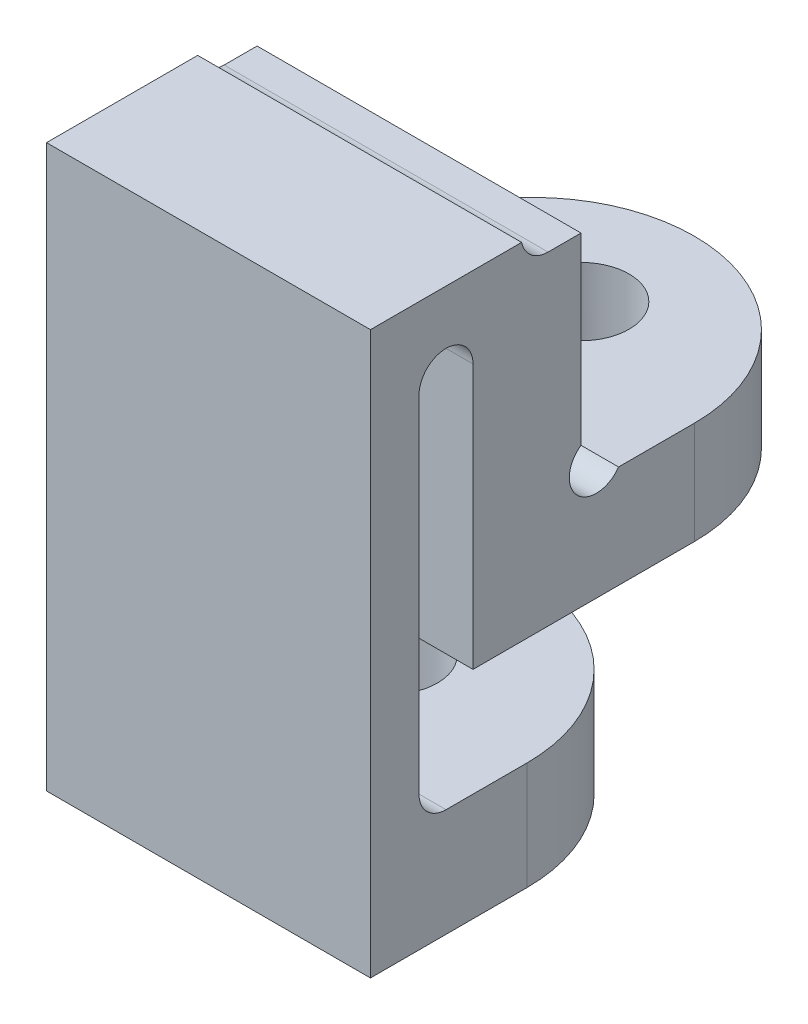
ISO-10303-21;
HEADER;
FILE_DESCRIPTION(('STEP AP214'),'2;1');
FILE_NAME('part.step','',(''),(''),'','','');
FILE_SCHEMA(('AUTOMOTIVE_DESIGN { 1 0 10303 214 1 1 1 1 }'));
ENDSEC;
DATA;
#1=APPLICATION_CONTEXT('core data for automotive mechanical design processes');
#2=APPLICATION_PROTOCOL_DEFINITION('international standard','automotive_design',2000,#1);
#3=PRODUCT_CONTEXT('',#1,'mechanical');
#4=PRODUCT('Part','Part','',(#3));
#5=PRODUCT_RELATED_PRODUCT_CATEGORY('part','',(#4));
#6=PRODUCT_DEFINITION_FORMATION('','',#4);
#7=PRODUCT_DEFINITION_CONTEXT('part definition',#1,'design');
#8=PRODUCT_DEFINITION('design','',#6,#7);
#9=PRODUCT_DEFINITION_SHAPE('','',#8);
#10=(LENGTH_UNIT() NAMED_UNIT(*) SI_UNIT(.MILLI.,.METRE.));
#11=(NAMED_UNIT(*) PLANE_ANGLE_UNIT() SI_UNIT($,.RADIAN.));
#12=(NAMED_UNIT(*) SI_UNIT($,.STERADIAN.) SOLID_ANGLE_UNIT());
#13=UNCERTAINTY_MEASURE_WITH_UNIT(LENGTH_MEASURE(1.E-05),#10,'distance_accuracy_value','');
#14=(GEOMETRIC_REPRESENTATION_CONTEXT(3) GLOBAL_UNCERTAINTY_ASSIGNED_CONTEXT((#13)) GLOBAL_UNIT_ASSIGNED_CONTEXT((#10,
#11,#12)) REPRESENTATION_CONTEXT('',''));
#15=CARTESIAN_POINT('',(0.,0.,0.));
#16=DIRECTION('',(0.,0.,1.));
#17=DIRECTION('',(1.,0.,0.));
#18=AXIS2_PLACEMENT_3D('',#15,#16,#17);
#19=CARTESIAN_POINT('',(1.5,6.89757709877801,2.9));
#20=DIRECTION('',(0.,0.,1.));
#21=DIRECTION('',(0.,-1.,0.));
#22=AXIS2_PLACEMENT_3D('',#19,#20,#21);
#23=PLANE('',#22);
#24=DIRECTION('',(0.,-1.,0.));
#25=VECTOR('',#24,1.);
#26=CARTESIAN_POINT('',(7.5,6.89757709877801,2.9));
#27=LINE('',#26,#25);
#28=CARTESIAN_POINT('',(7.5,6.89757709877801,2.9));
#29=VERTEX_POINT('',#28);
#30=CARTESIAN_POINT('',(7.5,-3.50242290122199,2.9));
#31=VERTEX_POINT('',#30);
#32=EDGE_CURVE('E213',#29,#31,#27,.T.);
#33=ORIENTED_EDGE('',*,*,#32,.F.);
#34=DIRECTION('',(1.,0.,0.));
#35=VECTOR('',#34,1.);
#36=CARTESIAN_POINT('',(1.5,6.89757709877801,2.9));
#37=LINE('',#36,#35);
#38=CARTESIAN_POINT('',(1.5,6.89757709877801,2.9));
#39=VERTEX_POINT('',#38);
#40=EDGE_CURVE('E274',#39,#29,#37,.T.);
#41=ORIENTED_EDGE('',*,*,#40,.F.);
#42=DIRECTION('',(0.,-1.,0.));
#43=VECTOR('',#42,1.);
#44=CARTESIAN_POINT('',(1.5,6.89757709877801,2.9));
#45=LINE('',#44,#43);
#46=CARTESIAN_POINT('',(1.5,-3.50242290122199,2.9));
#47=VERTEX_POINT('',#46);
#48=EDGE_CURVE('E214',#39,#47,#45,.T.);
#49=ORIENTED_EDGE('',*,*,#48,.T.);
#50=DIRECTION('',(1.,0.,0.));
#51=VECTOR('',#50,1.);
#52=CARTESIAN_POINT('',(1.5,-3.50242290122199,2.9));
#53=LINE('',#52,#51);
#54=EDGE_CURVE('E245',#47,#31,#53,.T.);
#55=ORIENTED_EDGE('',*,*,#54,.T.);
#56=EDGE_LOOP('',(#33,#41,#49,#55));
#57=FACE_BOUND('',#56,.T.);
#58=ADVANCED_FACE('F45',(#57),#23,.T.);
#59=CARTESIAN_POINT('',(1.5,6.89757709877801,-6.1));
#60=DIRECTION('',(0.,1.,0.));
#61=DIRECTION('',(0.,0.,1.));
#62=AXIS2_PLACEMENT_3D('',#59,#60,#61);
#63=PLANE('',#62);
#64=DIRECTION('',(1.,0.,0.));
#65=VECTOR('',#64,1.);
#66=CARTESIAN_POINT('',(1.5,6.89757709877801,0.1));
#67=LINE('',#66,#65);
#68=CARTESIAN_POINT('',(1.5,6.89757709877801,0.0999999999999998));
#69=VERTEX_POINT('',#68);
#70=CARTESIAN_POINT('',(7.5,6.89757709877801,0.0999999999999998));
#71=VERTEX_POINT('',#70);
#72=EDGE_CURVE('E209',#69,#71,#67,.T.);
#73=ORIENTED_EDGE('',*,*,#72,.F.);
#74=DIRECTION('',(0.,0.,1.));
#75=VECTOR('',#74,1.);
#76=CARTESIAN_POINT('',(1.5,6.89757709877801,-6.1));
#77=LINE('',#76,#75);
#78=EDGE_CURVE('E242',#69,#39,#77,.T.);
#79=ORIENTED_EDGE('',*,*,#78,.T.);
#80=ORIENTED_EDGE('',*,*,#40,.T.);
#81=DIRECTION('',(0.,0.,1.));
#82=VECTOR('',#81,1.);
#83=CARTESIAN_POINT('',(7.5,6.89757709877801,-6.1));
#84=LINE('',#83,#82);
#85=EDGE_CURVE('E219',#71,#29,#84,.T.);
#86=ORIENTED_EDGE('',*,*,#85,.F.);
#87=EDGE_LOOP('',(#73,#79,#80,#86));
#88=FACE_BOUND('',#87,.T.);
#89=ADVANCED_FACE('F434',(#88),#63,.T.);
#90=CARTESIAN_POINT('',(1.5,0.497577098778013,-6.1));
#91=DIRECTION('',(0.,-1.,0.));
#92=DIRECTION('',(0.,0.,-1.));
#93=AXIS2_PLACEMENT_3D('',#90,#91,#92);
#94=PLANE('',#93);
#95=CARTESIAN_POINT('',(4.5,0.497577098778013,-3.99999999999999));
#96=DIRECTION('',(0.,-1.,0.));
#97=DIRECTION('',(0.,0.,-1.));
#98=AXIS2_PLACEMENT_3D('',#95,#96,#97);
#99=CIRCLE('',#98,0.888999999999994);
#100=CARTESIAN_POINT('',(4.5,0.497577098778013,-4.88899999999999));
#101=VERTEX_POINT('',#100);
#102=EDGE_CURVE('E339',#101,#101,#99,.T.);
#103=ORIENTED_EDGE('',*,*,#102,.F.);
#104=EDGE_LOOP('',(#103));
#105=FACE_BOUND('',#104,.T.);
#106=CARTESIAN_POINT('',(4.5,0.497577098778013,-3.1));
#107=DIRECTION('',(0.,-1.,0.));
#108=DIRECTION('',(0.,0.,-1.));
#109=AXIS2_PLACEMENT_3D('',#106,#107,#108);
#110=CIRCLE('',#109,3.);
#111=CARTESIAN_POINT('',(1.5,0.497577098778013,-3.1));
#112=VERTEX_POINT('',#111);
#113=CARTESIAN_POINT('',(4.5,0.497577098778013,-6.1));
#114=VERTEX_POINT('',#113);
#115=EDGE_CURVE('E307',#112,#114,#110,.T.);
#116=ORIENTED_EDGE('',*,*,#115,.T.);
#117=CARTESIAN_POINT('',(4.5,0.497577098778013,-3.1));
#118=DIRECTION('',(0.,-1.,0.));
#119=DIRECTION('',(0.,0.,-1.));
#120=AXIS2_PLACEMENT_3D('',#117,#118,#119);
#121=CIRCLE('',#120,3.);
#122=CARTESIAN_POINT('',(7.5,0.497577098778013,-3.1));
#123=VERTEX_POINT('',#122);
#124=EDGE_CURVE('E310',#114,#123,#121,.T.);
#125=ORIENTED_EDGE('',*,*,#124,.T.);
#126=DIRECTION('',(0.,0.,-1.));
#127=VECTOR('',#126,1.);
#128=CARTESIAN_POINT('',(7.5,0.497577098778013,-6.1));
#129=LINE('',#128,#127);
#130=CARTESIAN_POINT('',(7.5,0.497577098778013,1.));
#131=VERTEX_POINT('',#130);
#132=EDGE_CURVE('E268',#131,#123,#129,.T.);
#133=ORIENTED_EDGE('',*,*,#132,.F.);
#134=DIRECTION('',(1.,0.,0.));
#135=VECTOR('',#134,1.);
#136=CARTESIAN_POINT('',(1.5,0.497577098778013,1.));
#137=LINE('',#136,#135);
#138=CARTESIAN_POINT('',(1.5,0.497577098778013,1.));
#139=VERTEX_POINT('',#138);
#140=EDGE_CURVE('E279',#139,#131,#137,.T.);
#141=ORIENTED_EDGE('',*,*,#140,.F.);
#142=DIRECTION('',(0.,0.,-1.));
#143=VECTOR('',#142,1.);
#144=CARTESIAN_POINT('',(1.5,0.497577098778013,-6.1));
#145=LINE('',#144,#143);
#146=EDGE_CURVE('E238',#139,#112,#145,.T.);
#147=ORIENTED_EDGE('',*,*,#146,.T.);
#148=EDGE_LOOP('',(#116,#125,#133,#141,#147));
#149=FACE_BOUND('',#148,.T.);
#150=ADVANCED_FACE('F390',(#105,#149),#94,.T.);
#151=CARTESIAN_POINT('',(1.5,0.497577098778013,1.));
#152=DIRECTION('',(0.,0.,1.));
#153=DIRECTION('',(0.,-1.,0.));
#154=AXIS2_PLACEMENT_3D('',#151,#152,#153);
#155=PLANE('',#154);
#156=DIRECTION('',(0.,-1.,0.));
#157=VECTOR('',#156,1.);
#158=CARTESIAN_POINT('',(7.5,0.497577098778013,1.));
#159=LINE('',#158,#157);
#160=CARTESIAN_POINT('',(7.5,5.39757709877801,0.999999999999999));
#161=VERTEX_POINT('',#160);
#162=EDGE_CURVE('E264',#161,#131,#159,.T.);
#163=ORIENTED_EDGE('',*,*,#162,.F.);
#164=DIRECTION('',(1.,0.,0.));
#165=VECTOR('',#164,1.);
#166=CARTESIAN_POINT('',(1.5,5.39757709877801,0.999999999999999));
#167=LINE('',#166,#165);
#168=CARTESIAN_POINT('',(1.5,5.39757709877801,0.999999999999999));
#169=VERTEX_POINT('',#168);
#170=EDGE_CURVE('E282',#169,#161,#167,.T.);
#171=ORIENTED_EDGE('',*,*,#170,.F.);
#172=DIRECTION('',(0.,-1.,0.));
#173=VECTOR('',#172,1.);
#174=CARTESIAN_POINT('',(1.5,0.497577098778013,1.));
#175=LINE('',#174,#173);
#176=EDGE_CURVE('E234',#169,#139,#175,.T.);
#177=ORIENTED_EDGE('',*,*,#176,.T.);
#178=ORIENTED_EDGE('',*,*,#140,.T.);
#179=EDGE_LOOP('',(#163,#171,#177,#178));
#180=FACE_BOUND('',#179,.T.);
#181=ADVANCED_FACE('F394',(#180),#155,.T.);
#182=CARTESIAN_POINT('',(1.5,5.39757709877801,1.5));
#183=DIRECTION('',(1.,0.,0.));
#184=DIRECTION('',(0.,0.,-1.));
#185=AXIS2_PLACEMENT_3D('',#182,#183,#184);
#186=CYLINDRICAL_SURFACE('',#185,0.500000000000001);
#187=CARTESIAN_POINT('',(7.5,5.39757709877801,1.5));
#188=DIRECTION('',(-1.,0.,0.));
#189=DIRECTION('',(0.,0.,1.));
#190=AXIS2_PLACEMENT_3D('',#187,#188,#189);
#191=CIRCLE('',#190,0.500000000000001);
#192=CARTESIAN_POINT('',(7.5,5.39757709877801,2.));
#193=VERTEX_POINT('',#192);
#194=EDGE_CURVE('E260',#193,#161,#191,.T.);
#195=ORIENTED_EDGE('',*,*,#194,.F.);
#196=DIRECTION('',(1.,0.,0.));
#197=VECTOR('',#196,1.);
#198=CARTESIAN_POINT('',(1.5,5.39757709877801,2.));
#199=LINE('',#198,#197);
#200=CARTESIAN_POINT('',(1.5,5.39757709877801,2.));
#201=VERTEX_POINT('',#200);
#202=EDGE_CURVE('E285',#201,#193,#199,.T.);
#203=ORIENTED_EDGE('',*,*,#202,.F.);
#204=CARTESIAN_POINT('',(1.5,5.39757709877801,1.5));
#205=DIRECTION('',(-1.,0.,0.));
#206=DIRECTION('',(0.,0.,1.));
#207=AXIS2_PLACEMENT_3D('',#204,#205,#206);
#208=CIRCLE('',#207,0.500000000000001);
#209=EDGE_CURVE('E230',#201,#169,#208,.T.);
#210=ORIENTED_EDGE('',*,*,#209,.T.);
#211=ORIENTED_EDGE('',*,*,#170,.T.);
#212=EDGE_LOOP('',(#195,#203,#210,#211));
#213=FACE_BOUND('',#212,.T.);
#214=ADVANCED_FACE('F401',(#213),#186,.F.);
#215=CARTESIAN_POINT('',(1.5,0.497577098778013,2.));
#216=DIRECTION('',(0.,0.,-1.));
#217=DIRECTION('',(0.,1.,0.));
#218=AXIS2_PLACEMENT_3D('',#215,#216,#217);
#219=PLANE('',#218);
#220=DIRECTION('',(0.,1.,0.));
#221=VECTOR('',#220,1.);
#222=CARTESIAN_POINT('',(7.5,0.497577098778013,2.));
#223=LINE('',#222,#221);
#224=CARTESIAN_POINT('',(7.5,-1.00242290122199,2.));
#225=VERTEX_POINT('',#224);
#226=EDGE_CURVE('E257',#225,#193,#223,.T.);
#227=ORIENTED_EDGE('',*,*,#226,.F.);
#228=DIRECTION('',(1.,0.,0.));
#229=VECTOR('',#228,1.);
#230=CARTESIAN_POINT('',(1.5,-1.00242290122199,2.));
#231=LINE('',#230,#229);
#232=CARTESIAN_POINT('',(1.5,-1.00242290122199,2.));
#233=VERTEX_POINT('',#232);
#234=EDGE_CURVE('E343',#225,#233,#231,.F.);
#235=ORIENTED_EDGE('',*,*,#234,.T.);
#236=DIRECTION('',(0.,1.,0.));
#237=VECTOR('',#236,1.);
#238=CARTESIAN_POINT('',(1.5,0.497577098778013,2.));
#239=LINE('',#238,#237);
#240=EDGE_CURVE('E227',#233,#201,#239,.T.);
#241=ORIENTED_EDGE('',*,*,#240,.T.);
#242=ORIENTED_EDGE('',*,*,#202,.T.);
#243=EDGE_LOOP('',(#227,#235,#241,#242));
#244=FACE_BOUND('',#243,.T.);
#245=ADVANCED_FACE('F404',(#244),#219,.T.);
#246=CARTESIAN_POINT('',(1.5,-1.50242290122199,2.));
#247=DIRECTION('',(0.,1.,0.));
#248=DIRECTION('',(0.,0.,1.));
#249=AXIS2_PLACEMENT_3D('',#246,#247,#248);
#250=PLANE('',#249);
#251=CARTESIAN_POINT('',(4.5,-1.50242290122199,-0.45));
#252=DIRECTION('',(0.,1.,0.));
#253=DIRECTION('',(0.,0.,1.));
#254=AXIS2_PLACEMENT_3D('',#251,#252,#253);
#255=CIRCLE('',#254,0.888999999999989);
#256=CARTESIAN_POINT('',(4.5,-1.50242290122199,0.438999999999989));
#257=VERTEX_POINT('',#256);
#258=EDGE_CURVE('E178',#257,#257,#255,.T.);
#259=ORIENTED_EDGE('',*,*,#258,.F.);
#260=EDGE_LOOP('',(#259));
#261=FACE_BOUND('',#260,.T.);
#262=DIRECTION('',(0.,0.,1.));
#263=VECTOR('',#262,1.);
#264=CARTESIAN_POINT('',(1.5,-1.50242290122199,2.));
#265=LINE('',#264,#263);
#266=CARTESIAN_POINT('',(1.5,-1.50242290122199,0.));
#267=VERTEX_POINT('',#266);
#268=CARTESIAN_POINT('',(1.5,-1.50242290122199,1.5));
#269=VERTEX_POINT('',#268);
#270=EDGE_CURVE('E223',#267,#269,#265,.T.);
#271=ORIENTED_EDGE('',*,*,#270,.T.);
#272=DIRECTION('',(1.,0.,0.));
#273=VECTOR('',#272,1.);
#274=CARTESIAN_POINT('',(7.5,-1.50242290122199,1.5));
#275=LINE('',#274,#273);
#276=CARTESIAN_POINT('',(7.5,-1.50242290122199,1.5));
#277=VERTEX_POINT('',#276);
#278=EDGE_CURVE('E331',#269,#277,#275,.T.);
#279=ORIENTED_EDGE('',*,*,#278,.T.);
#280=DIRECTION('',(0.,0.,1.));
#281=VECTOR('',#280,1.);
#282=CARTESIAN_POINT('',(7.5,-1.50242290122199,2.));
#283=LINE('',#282,#281);
#284=CARTESIAN_POINT('',(7.5,-1.50242290122199,0.));
#285=VERTEX_POINT('',#284);
#286=EDGE_CURVE('E253',#285,#277,#283,.T.);
#287=ORIENTED_EDGE('',*,*,#286,.F.);
#288=CARTESIAN_POINT('',(4.5,-1.50242290122199,0.));
#289=DIRECTION('',(0.,1.,0.));
#290=DIRECTION('',(0.,0.,1.));
#291=AXIS2_PLACEMENT_3D('',#288,#289,#290);
#292=CIRCLE('',#291,3.);
#293=CARTESIAN_POINT('',(4.5,-1.50242290122199,-3.));
#294=VERTEX_POINT('',#293);
#295=EDGE_CURVE('E322',#285,#294,#292,.T.);
#296=ORIENTED_EDGE('',*,*,#295,.T.);
#297=CARTESIAN_POINT('',(4.5,-1.50242290122199,0.));
#298=DIRECTION('',(0.,1.,0.));
#299=DIRECTION('',(0.,0.,1.));
#300=AXIS2_PLACEMENT_3D('',#297,#298,#299);
#301=CIRCLE('',#300,3.);
#302=EDGE_CURVE('E319',#294,#267,#301,.T.);
#303=ORIENTED_EDGE('',*,*,#302,.T.);
#304=EDGE_LOOP('',(#271,#279,#287,#296,#303));
#305=FACE_BOUND('',#304,.T.);
#306=ADVANCED_FACE('F413',(#261,#305),#250,.T.);
#307=CARTESIAN_POINT('',(1.5,-3.50242290122199,-3.));
#308=DIRECTION('',(0.,-1.,0.));
#309=DIRECTION('',(0.,0.,-1.));
#310=AXIS2_PLACEMENT_3D('',#307,#308,#309);
#311=PLANE('',#310);
#312=CARTESIAN_POINT('',(4.5,-3.50242290122199,-0.45));
#313=DIRECTION('',(0.,-1.,0.));
#314=DIRECTION('',(0.,0.,-1.));
#315=AXIS2_PLACEMENT_3D('',#312,#313,#314);
#316=CIRCLE('',#315,0.888999999999994);
#317=CARTESIAN_POINT('',(4.5,-3.50242290122199,-1.33899999999999));
#318=VERTEX_POINT('',#317);
#319=EDGE_CURVE('E358',#318,#318,#316,.T.);
#320=ORIENTED_EDGE('',*,*,#319,.F.);
#321=EDGE_LOOP('',(#320));
#322=FACE_BOUND('',#321,.T.);
#323=CARTESIAN_POINT('',(4.5,-3.50242290122199,0.));
#324=DIRECTION('',(0.,-1.,0.));
#325=DIRECTION('',(0.,0.,-1.));
#326=AXIS2_PLACEMENT_3D('',#323,#324,#325);
#327=CIRCLE('',#326,3.);
#328=CARTESIAN_POINT('',(1.5,-3.50242290122199,0.));
#329=VERTEX_POINT('',#328);
#330=CARTESIAN_POINT('',(4.5,-3.50242290122199,-3.));
#331=VERTEX_POINT('',#330);
#332=EDGE_CURVE('E325',#329,#331,#327,.T.);
#333=ORIENTED_EDGE('',*,*,#332,.T.);
#334=CARTESIAN_POINT('',(4.5,-3.50242290122199,0.));
#335=DIRECTION('',(0.,-1.,0.));
#336=DIRECTION('',(0.,0.,-1.));
#337=AXIS2_PLACEMENT_3D('',#334,#335,#336);
#338=CIRCLE('',#337,3.);
#339=CARTESIAN_POINT('',(7.5,-3.50242290122199,0.));
#340=VERTEX_POINT('',#339);
#341=EDGE_CURVE('E328',#331,#340,#338,.T.);
#342=ORIENTED_EDGE('',*,*,#341,.T.);
#343=DIRECTION('',(0.,0.,-1.));
#344=VECTOR('',#343,1.);
#345=CARTESIAN_POINT('',(7.5,-3.50242290122199,-3.));
#346=LINE('',#345,#344);
#347=EDGE_CURVE('E249',#31,#340,#346,.T.);
#348=ORIENTED_EDGE('',*,*,#347,.F.);
#349=ORIENTED_EDGE('',*,*,#54,.F.);
#350=DIRECTION('',(0.,0.,-1.));
#351=VECTOR('',#350,1.);
#352=CARTESIAN_POINT('',(1.5,-3.50242290122199,-3.));
#353=LINE('',#352,#351);
#354=EDGE_CURVE('E218',#47,#329,#353,.T.);
#355=ORIENTED_EDGE('',*,*,#354,.T.);
#356=EDGE_LOOP('',(#333,#342,#348,#349,#355));
#357=FACE_BOUND('',#356,.T.);
#358=ADVANCED_FACE('F428',(#322,#357),#311,.T.);
#359=CARTESIAN_POINT('',(1.5,5.39757709877801,1.5));
#360=DIRECTION('',(-1.,0.,0.));
#361=DIRECTION('',(0.,0.,1.));
#362=AXIS2_PLACEMENT_3D('',#359,#360,#361);
#363=PLANE('',#362);
#364=CARTESIAN_POINT('',(1.5,2.68041981125263,-1.28284271247461));
#365=DIRECTION('',(-1.,0.,0.));
#366=DIRECTION('',(0.,0.,1.));
#367=AXIS2_PLACEMENT_3D('',#364,#365,#366);
#368=CIRCLE('',#367,0.5);
#369=CARTESIAN_POINT('',(1.5,2.39757709877802,-1.69515327503638));
#370=VERTEX_POINT('',#369);
#371=CARTESIAN_POINT('',(1.5,3.0927303738144,-0.999999999999993));
#372=VERTEX_POINT('',#371);
#373=EDGE_CURVE('E61',#370,#372,#368,.T.);
#374=ORIENTED_EDGE('',*,*,#373,.F.);
#375=DIRECTION('',(0.,0.,1.));
#376=VECTOR('',#375,1.);
#377=CARTESIAN_POINT('',(1.5,2.39757709877802,-1.70710678118655));
#378=LINE('',#377,#376);
#379=CARTESIAN_POINT('',(1.5,2.39757709877802,-3.1));
#380=VERTEX_POINT('',#379);
#381=EDGE_CURVE('E183',#380,#370,#378,.T.);
#382=ORIENTED_EDGE('',*,*,#381,.F.);
#383=DIRECTION('',(0.,1.,0.));
#384=VECTOR('',#383,1.);
#385=CARTESIAN_POINT('',(1.5,5.39757709877802,-3.1));
#386=LINE('',#385,#384);
#387=EDGE_CURVE('E316',#380,#112,#386,.F.);
#388=ORIENTED_EDGE('',*,*,#387,.T.);
#389=ORIENTED_EDGE('',*,*,#146,.F.);
#390=ORIENTED_EDGE('',*,*,#176,.F.);
#391=ORIENTED_EDGE('',*,*,#209,.F.);
#392=ORIENTED_EDGE('',*,*,#240,.F.);
#393=CARTESIAN_POINT('',(1.5,-1.00242290122199,1.5));
#394=DIRECTION('',(-1.,0.,0.));
#395=DIRECTION('',(0.,0.,1.));
#396=AXIS2_PLACEMENT_3D('',#393,#394,#395);
#397=CIRCLE('',#396,0.5);
#398=EDGE_CURVE('E352',#233,#269,#397,.F.);
#399=ORIENTED_EDGE('',*,*,#398,.T.);
#400=ORIENTED_EDGE('',*,*,#270,.F.);
#401=DIRECTION('',(0.,1.,0.));
#402=VECTOR('',#401,1.);
#403=CARTESIAN_POINT('',(1.5,5.39757709877801,0.));
#404=LINE('',#403,#402);
#405=EDGE_CURVE('E313',#267,#329,#404,.F.);
#406=ORIENTED_EDGE('',*,*,#405,.T.);
#407=ORIENTED_EDGE('',*,*,#354,.F.);
#408=ORIENTED_EDGE('',*,*,#48,.F.);
#409=ORIENTED_EDGE('',*,*,#78,.F.);
#410=CARTESIAN_POINT('',(1.5,6.99757709877801,-0.389897948556636));
#411=DIRECTION('',(-1.,0.,0.));
#412=DIRECTION('',(0.,0.,1.));
#413=AXIS2_PLACEMENT_3D('',#410,#411,#412);
#414=CIRCLE('',#413,0.5);
#415=CARTESIAN_POINT('',(1.5,6.49757709877801,-0.389897948556636));
#416=VERTEX_POINT('',#415);
#417=EDGE_CURVE('E68',#69,#416,#414,.F.);
#418=ORIENTED_EDGE('',*,*,#417,.T.);
#419=DIRECTION('',(0.,0.,1.));
#420=VECTOR('',#419,1.);
#421=CARTESIAN_POINT('',(1.5,6.49757709877801,0.0999999999999998));
#422=LINE('',#421,#420);
#423=CARTESIAN_POINT('',(1.5,6.49757709877801,-0.999999999999993));
#424=VERTEX_POINT('',#423);
#425=EDGE_CURVE('E206',#424,#416,#422,.T.);
#426=ORIENTED_EDGE('',*,*,#425,.F.);
#427=DIRECTION('',(0.,1.,0.));
#428=VECTOR('',#427,1.);
#429=CARTESIAN_POINT('',(1.5,3.20468387996456,-0.999999999999993));
#430=LINE('',#429,#428);
#431=EDGE_CURVE('E185',#372,#424,#430,.T.);
#432=ORIENTED_EDGE('',*,*,#431,.F.);
#433=EDGE_LOOP('',(#374,#382,#388,#389,#390,#391,#392,#399,#400,#406,#407,#408,#409,#418,#426,#432));
#434=FACE_BOUND('',#433,.T.);
#435=ADVANCED_FACE('F182',(#434),#363,.T.);
#436=CARTESIAN_POINT('',(7.5,5.39757709877801,1.5));
#437=DIRECTION('',(-1.,0.,0.));
#438=DIRECTION('',(0.,0.,1.));
#439=AXIS2_PLACEMENT_3D('',#436,#437,#438);
#440=PLANE('',#439);
#441=DIRECTION('',(0.,0.,1.));
#442=VECTOR('',#441,1.);
#443=CARTESIAN_POINT('',(7.5,2.39757709877802,-1.70710678118655));
#444=LINE('',#443,#442);
#445=CARTESIAN_POINT('',(7.5,2.39757709877802,-3.1));
#446=VERTEX_POINT('',#445);
#447=CARTESIAN_POINT('',(7.5,2.39757709877802,-1.69515327503638));
#448=VERTEX_POINT('',#447);
#449=EDGE_CURVE('E196',#446,#448,#444,.T.);
#450=ORIENTED_EDGE('',*,*,#449,.T.);
#451=CARTESIAN_POINT('',(7.5,2.68041981125263,-1.28284271247461));
#452=DIRECTION('',(-1.,0.,0.));
#453=DIRECTION('',(0.,0.,1.));
#454=AXIS2_PLACEMENT_3D('',#451,#452,#453);
#455=CIRCLE('',#454,0.5);
#456=CARTESIAN_POINT('',(7.5,3.0927303738144,-0.999999999999993));
#457=VERTEX_POINT('',#456);
#458=EDGE_CURVE('E172',#448,#457,#455,.T.);
#459=ORIENTED_EDGE('',*,*,#458,.T.);
#460=DIRECTION('',(0.,1.,0.));
#461=VECTOR('',#460,1.);
#462=CARTESIAN_POINT('',(7.5,2.39757709877802,-0.999999999999993));
#463=LINE('',#462,#461);
#464=CARTESIAN_POINT('',(7.5,6.49757709877801,-0.999999999999993));
#465=VERTEX_POINT('',#464);
#466=EDGE_CURVE('E192',#457,#465,#463,.T.);
#467=ORIENTED_EDGE('',*,*,#466,.T.);
#468=DIRECTION('',(0.,0.,1.));
#469=VECTOR('',#468,1.);
#470=CARTESIAN_POINT('',(7.5,6.49757709877801,1.5));
#471=LINE('',#470,#469);
#472=CARTESIAN_POINT('',(7.5,6.49757709877801,-0.389897948556636));
#473=VERTEX_POINT('',#472);
#474=EDGE_CURVE('E278',#465,#473,#471,.T.);
#475=ORIENTED_EDGE('',*,*,#474,.T.);
#476=CARTESIAN_POINT('',(7.5,6.99757709877801,-0.389897948556636));
#477=DIRECTION('',(-1.,0.,0.));
#478=DIRECTION('',(0.,0.,1.));
#479=AXIS2_PLACEMENT_3D('',#476,#477,#478);
#480=CIRCLE('',#479,0.5);
#481=EDGE_CURVE('E54',#473,#71,#480,.T.);
#482=ORIENTED_EDGE('',*,*,#481,.T.);
#483=ORIENTED_EDGE('',*,*,#85,.T.);
#484=ORIENTED_EDGE('',*,*,#32,.T.);
#485=ORIENTED_EDGE('',*,*,#347,.T.);
#486=DIRECTION('',(0.,1.,0.));
#487=VECTOR('',#486,1.);
#488=CARTESIAN_POINT('',(7.5,-1.50242290122199,0.));
#489=LINE('',#488,#487);
#490=EDGE_CURVE('E294',#340,#285,#489,.T.);
#491=ORIENTED_EDGE('',*,*,#490,.T.);
#492=ORIENTED_EDGE('',*,*,#286,.T.);
#493=CARTESIAN_POINT('',(7.5,-1.00242290122199,1.5));
#494=DIRECTION('',(-1.,0.,0.));
#495=DIRECTION('',(0.,0.,1.));
#496=AXIS2_PLACEMENT_3D('',#493,#494,#495);
#497=CIRCLE('',#496,0.5);
#498=EDGE_CURVE('E349',#277,#225,#497,.T.);
#499=ORIENTED_EDGE('',*,*,#498,.T.);
#500=ORIENTED_EDGE('',*,*,#226,.T.);
#501=ORIENTED_EDGE('',*,*,#194,.T.);
#502=ORIENTED_EDGE('',*,*,#162,.T.);
#503=ORIENTED_EDGE('',*,*,#132,.T.);
#504=DIRECTION('',(0.,1.,0.));
#505=VECTOR('',#504,1.);
#506=CARTESIAN_POINT('',(7.5,2.39757709877801,-3.1));
#507=LINE('',#506,#505);
#508=EDGE_CURVE('E298',#123,#446,#507,.T.);
#509=ORIENTED_EDGE('',*,*,#508,.T.);
#510=EDGE_LOOP('',(#450,#459,#467,#475,#482,#483,#484,#485,#491,#492,#499,#500,#501,#502,#503,#509));
#511=FACE_BOUND('',#510,.T.);
#512=ADVANCED_FACE('F378',(#511),#440,.F.);
#513=CARTESIAN_POINT('',(7.5,6.49757709877801,0.0999999999999998));
#514=DIRECTION('',(0.,-1.,0.));
#515=DIRECTION('',(0.,0.,-1.));
#516=AXIS2_PLACEMENT_3D('',#513,#514,#515);
#517=PLANE('',#516);
#518=ORIENTED_EDGE('',*,*,#425,.T.);
#519=DIRECTION('',(-1.,0.,0.));
#520=VECTOR('',#519,1.);
#521=CARTESIAN_POINT('',(7.5,6.49757709877801,-0.389897948556636));
#522=LINE('',#521,#520);
#523=EDGE_CURVE('E346',#416,#473,#522,.F.);
#524=ORIENTED_EDGE('',*,*,#523,.T.);
#525=ORIENTED_EDGE('',*,*,#474,.F.);
#526=DIRECTION('',(-1.,0.,0.));
#527=VECTOR('',#526,1.);
#528=CARTESIAN_POINT('',(7.5,6.49757709877801,-0.999999999999993));
#529=LINE('',#528,#527);
#530=EDGE_CURVE('E202',#465,#424,#529,.T.);
#531=ORIENTED_EDGE('',*,*,#530,.T.);
#532=EDGE_LOOP('',(#518,#524,#525,#531));
#533=FACE_BOUND('',#532,.T.);
#534=ADVANCED_FACE('F441',(#533),#517,.F.);
#535=CARTESIAN_POINT('',(7.5,2.39757709877802,-1.70710678118655));
#536=DIRECTION('',(0.,-1.,0.));
#537=DIRECTION('',(0.,0.,-1.));
#538=AXIS2_PLACEMENT_3D('',#535,#536,#537);
#539=PLANE('',#538);
#540=CARTESIAN_POINT('',(4.5,2.39757709877802,-3.99999999999999));
#541=DIRECTION('',(0.,1.,0.));
#542=DIRECTION('',(0.,0.,1.));
#543=AXIS2_PLACEMENT_3D('',#540,#541,#542);
#544=CIRCLE('',#543,0.888999999999989);
#545=CARTESIAN_POINT('',(4.5,2.39757709877802,-3.111));
#546=VERTEX_POINT('',#545);
#547=EDGE_CURVE('E361',#546,#546,#544,.T.);
#548=ORIENTED_EDGE('',*,*,#547,.F.);
#549=EDGE_LOOP('',(#548));
#550=FACE_BOUND('',#549,.T.);
#551=ORIENTED_EDGE('',*,*,#381,.T.);
#552=DIRECTION('',(-1.,0.,0.));
#553=VECTOR('',#552,1.);
#554=CARTESIAN_POINT('',(11.5,2.39757709877802,-1.69515327503638));
#555=LINE('',#554,#553);
#556=EDGE_CURVE('E169',#370,#448,#555,.F.);
#557=ORIENTED_EDGE('',*,*,#556,.T.);
#558=ORIENTED_EDGE('',*,*,#449,.F.);
#559=CARTESIAN_POINT('',(4.5,2.39757709877802,-3.1));
#560=DIRECTION('',(0.,-1.,0.));
#561=DIRECTION('',(0.,0.,-1.));
#562=AXIS2_PLACEMENT_3D('',#559,#560,#561);
#563=CIRCLE('',#562,3.);
#564=CARTESIAN_POINT('',(4.5,2.39757709877802,-6.1));
#565=VERTEX_POINT('',#564);
#566=EDGE_CURVE('E304',#446,#565,#563,.F.);
#567=ORIENTED_EDGE('',*,*,#566,.T.);
#568=CARTESIAN_POINT('',(4.5,2.39757709877802,-3.1));
#569=DIRECTION('',(0.,-1.,0.));
#570=DIRECTION('',(0.,0.,-1.));
#571=AXIS2_PLACEMENT_3D('',#568,#569,#570);
#572=CIRCLE('',#571,3.);
#573=EDGE_CURVE('E190',#565,#380,#572,.F.);
#574=ORIENTED_EDGE('',*,*,#573,.T.);
#575=EDGE_LOOP('',(#551,#557,#558,#567,#574));
#576=FACE_BOUND('',#575,.T.);
#577=ADVANCED_FACE('F188',(#550,#576),#539,.F.);
#578=CARTESIAN_POINT('',(7.5,3.20468387996456,-0.999999999999993));
#579=DIRECTION('',(0.,0.,1.));
#580=DIRECTION('',(1.,0.,0.));
#581=AXIS2_PLACEMENT_3D('',#578,#579,#580);
#582=PLANE('',#581);
#583=ORIENTED_EDGE('',*,*,#466,.F.);
#584=DIRECTION('',(-1.,0.,0.));
#585=VECTOR('',#584,1.);
#586=CARTESIAN_POINT('',(11.5,3.0927303738144,-0.999999999999993));
#587=LINE('',#586,#585);
#588=EDGE_CURVE('E11',#457,#372,#587,.T.);
#589=ORIENTED_EDGE('',*,*,#588,.T.);
#590=ORIENTED_EDGE('',*,*,#431,.T.);
#591=ORIENTED_EDGE('',*,*,#530,.F.);
#592=EDGE_LOOP('',(#583,#589,#590,#591));
#593=FACE_BOUND('',#592,.T.);
#594=ADVANCED_FACE('F444',(#593),#582,.F.);
#595=CARTESIAN_POINT('',(4.5,6.89757709877801,-3.1));
#596=DIRECTION('',(0.,1.,0.));
#597=DIRECTION('',(0.,0.,1.));
#598=AXIS2_PLACEMENT_3D('',#595,#596,#597);
#599=CYLINDRICAL_SURFACE('',#598,3.);
#600=DIRECTION('',(0.,1.,0.));
#601=VECTOR('',#600,1.);
#602=CARTESIAN_POINT('',(4.5,6.89757709877801,-6.1));
#603=LINE('',#602,#601);
#604=EDGE_CURVE('E198',#114,#565,#603,.T.);
#605=ORIENTED_EDGE('',*,*,#604,.F.);
#606=ORIENTED_EDGE('',*,*,#115,.F.);
#607=ORIENTED_EDGE('',*,*,#387,.F.);
#608=ORIENTED_EDGE('',*,*,#573,.F.);
#609=EDGE_LOOP('',(#605,#606,#607,#608));
#610=FACE_BOUND('',#609,.T.);
#611=ADVANCED_FACE('F384',(#610),#599,.T.);
#612=CARTESIAN_POINT('',(4.5,5.39757709877802,-3.1));
#613=DIRECTION('',(0.,-1.,0.));
#614=DIRECTION('',(0.,0.,-1.));
#615=AXIS2_PLACEMENT_3D('',#612,#613,#614);
#616=CYLINDRICAL_SURFACE('',#615,3.);
#617=ORIENTED_EDGE('',*,*,#124,.F.);
#618=ORIENTED_EDGE('',*,*,#604,.T.);
#619=ORIENTED_EDGE('',*,*,#566,.F.);
#620=ORIENTED_EDGE('',*,*,#508,.F.);
#621=EDGE_LOOP('',(#617,#618,#619,#620));
#622=FACE_BOUND('',#621,.T.);
#623=ADVANCED_FACE('F387',(#622),#616,.T.);
#624=CARTESIAN_POINT('',(4.5,-1.50242290122199,0.));
#625=DIRECTION('',(0.,1.,0.));
#626=DIRECTION('',(0.,0.,1.));
#627=AXIS2_PLACEMENT_3D('',#624,#625,#626);
#628=CYLINDRICAL_SURFACE('',#627,3.);
#629=DIRECTION('',(0.,1.,0.));
#630=VECTOR('',#629,1.);
#631=CARTESIAN_POINT('',(4.5,-1.50242290122199,-3.));
#632=LINE('',#631,#630);
#633=EDGE_CURVE('E335',#331,#294,#632,.T.);
#634=ORIENTED_EDGE('',*,*,#633,.F.);
#635=ORIENTED_EDGE('',*,*,#332,.F.);
#636=ORIENTED_EDGE('',*,*,#405,.F.);
#637=ORIENTED_EDGE('',*,*,#302,.F.);
#638=EDGE_LOOP('',(#634,#635,#636,#637));
#639=FACE_BOUND('',#638,.T.);
#640=ADVANCED_FACE('F423',(#639),#628,.T.);
#641=CARTESIAN_POINT('',(4.5,5.39757709877801,0.));
#642=DIRECTION('',(0.,-1.,0.));
#643=DIRECTION('',(0.,0.,-1.));
#644=AXIS2_PLACEMENT_3D('',#641,#642,#643);
#645=CYLINDRICAL_SURFACE('',#644,3.);
#646=ORIENTED_EDGE('',*,*,#341,.F.);
#647=ORIENTED_EDGE('',*,*,#633,.T.);
#648=ORIENTED_EDGE('',*,*,#295,.F.);
#649=ORIENTED_EDGE('',*,*,#490,.F.);
#650=EDGE_LOOP('',(#646,#647,#648,#649));
#651=FACE_BOUND('',#650,.T.);
#652=ADVANCED_FACE('F418',(#651),#645,.T.);
#653=CARTESIAN_POINT('',(1.5,-1.00242290122199,1.5));
#654=DIRECTION('',(-1.,0.,0.));
#655=DIRECTION('',(0.,0.,1.));
#656=AXIS2_PLACEMENT_3D('',#653,#654,#655);
#657=CYLINDRICAL_SURFACE('',#656,0.5);
#658=ORIENTED_EDGE('',*,*,#398,.F.);
#659=ORIENTED_EDGE('',*,*,#234,.F.);
#660=ORIENTED_EDGE('',*,*,#498,.F.);
#661=ORIENTED_EDGE('',*,*,#278,.F.);
#662=EDGE_LOOP('',(#658,#659,#660,#661));
#663=FACE_BOUND('',#662,.T.);
#664=ADVANCED_FACE('F410',(#663),#657,.F.);
#665=CARTESIAN_POINT('',(7.5,6.99757709877801,-0.389897948556636));
#666=DIRECTION('',(-1.,0.,0.));
#667=DIRECTION('',(0.,0.,1.));
#668=AXIS2_PLACEMENT_3D('',#665,#666,#667);
#669=CYLINDRICAL_SURFACE('',#668,0.5);
#670=ORIENTED_EDGE('',*,*,#481,.F.);
#671=ORIENTED_EDGE('',*,*,#523,.F.);
#672=ORIENTED_EDGE('',*,*,#417,.F.);
#673=ORIENTED_EDGE('',*,*,#72,.T.);
#674=EDGE_LOOP('',(#670,#671,#672,#673));
#675=FACE_BOUND('',#674,.T.);
#676=ADVANCED_FACE('F47',(#675),#669,.F.);
#677=CARTESIAN_POINT('',(4.5,2.39757709877802,-3.99999999999999));
#678=DIRECTION('',(0.,1.,0.));
#679=DIRECTION('',(0.,0.,1.));
#680=AXIS2_PLACEMENT_3D('',#677,#678,#679);
#681=CYLINDRICAL_SURFACE('',#680,0.888999999999994);
#682=ORIENTED_EDGE('',*,*,#102,.T.);
#683=EDGE_LOOP('',(#682));
#684=FACE_BOUND('',#683,.T.);
#685=ORIENTED_EDGE('',*,*,#547,.T.);
#686=EDGE_LOOP('',(#685));
#687=FACE_BOUND('',#686,.T.);
#688=ADVANCED_FACE('F473',(#684,#687),#681,.F.);
#689=CARTESIAN_POINT('',(4.5,-1.50242290122199,-0.45));
#690=DIRECTION('',(0.,1.,0.));
#691=DIRECTION('',(0.,0.,1.));
#692=AXIS2_PLACEMENT_3D('',#689,#690,#691);
#693=CYLINDRICAL_SURFACE('',#692,0.888999999999994);
#694=ORIENTED_EDGE('',*,*,#319,.T.);
#695=EDGE_LOOP('',(#694));
#696=FACE_BOUND('',#695,.T.);
#697=ORIENTED_EDGE('',*,*,#258,.T.);
#698=EDGE_LOOP('',(#697));
#699=FACE_BOUND('',#698,.T.);
#700=ADVANCED_FACE('F477',(#696,#699),#693,.F.);
#701=CARTESIAN_POINT('',(11.5,2.68041981125263,-1.28284271247461));
#702=DIRECTION('',(-1.,0.,0.));
#703=DIRECTION('',(0.,0.,1.));
#704=AXIS2_PLACEMENT_3D('',#701,#702,#703);
#705=CYLINDRICAL_SURFACE('',#704,0.5);
#706=ORIENTED_EDGE('',*,*,#373,.T.);
#707=ORIENTED_EDGE('',*,*,#588,.F.);
#708=ORIENTED_EDGE('',*,*,#458,.F.);
#709=ORIENTED_EDGE('',*,*,#556,.F.);
#710=EDGE_LOOP('',(#706,#707,#708,#709));
#711=FACE_BOUND('',#710,.T.);
#712=ADVANCED_FACE('F170',(#711),#705,.F.);
#713=CLOSED_SHELL('',(#58,#89,#150,#181,#214,#245,#306,#358,#435,#512,#534,#577,#594,#611,#623,
#640,#652,#664,#676,#688,#700,#712));
#714=MANIFOLD_SOLID_BREP('B2',#713);
#715=ADVANCED_BREP_SHAPE_REPRESENTATION('',(#18,#714),#14);
#716=SHAPE_DEFINITION_REPRESENTATION(#9,#715);
ENDSEC;
END-ISO-10303-21;
